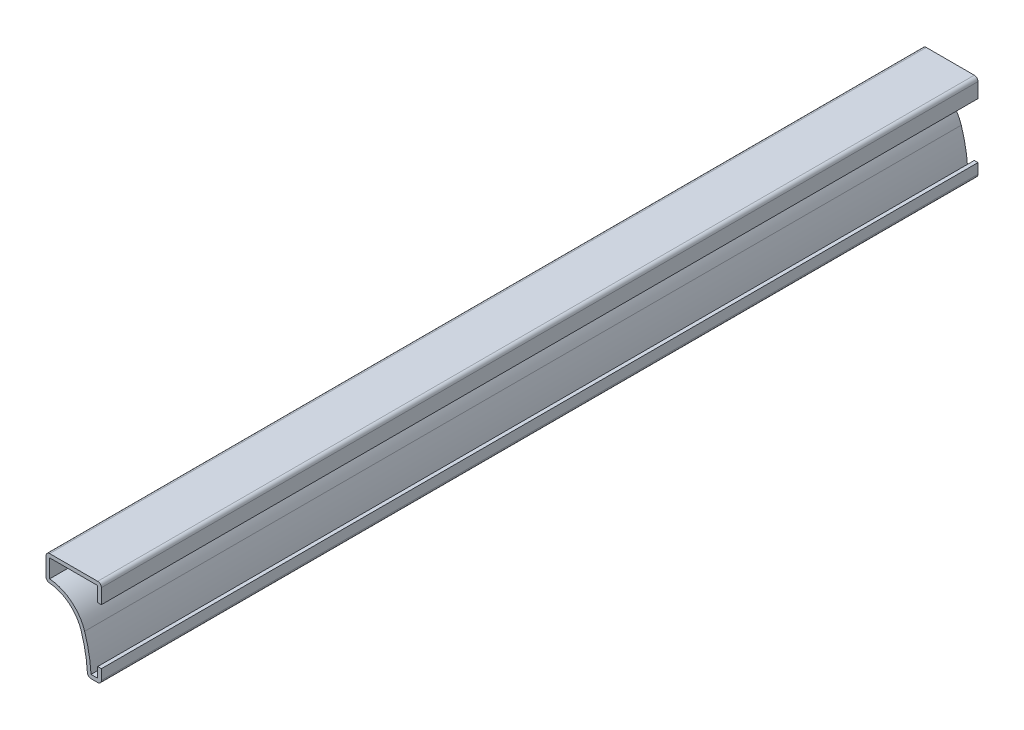
ISO-10303-21;
HEADER;
FILE_DESCRIPTION(('STEP AP214'),'2;1');
FILE_NAME('part.step','',(''),(''),'','','');
FILE_SCHEMA(('AUTOMOTIVE_DESIGN { 1 0 10303 214 1 1 1 1 }'));
ENDSEC;
DATA;
#1=APPLICATION_CONTEXT('core data for automotive mechanical design processes');
#2=APPLICATION_PROTOCOL_DEFINITION('international standard','automotive_design',2000,#1);
#3=PRODUCT_CONTEXT('',#1,'mechanical');
#4=PRODUCT('Part','Part','',(#3));
#5=PRODUCT_RELATED_PRODUCT_CATEGORY('part','',(#4));
#6=PRODUCT_DEFINITION_FORMATION('','',#4);
#7=PRODUCT_DEFINITION_CONTEXT('part definition',#1,'design');
#8=PRODUCT_DEFINITION('design','',#6,#7);
#9=PRODUCT_DEFINITION_SHAPE('','',#8);
#10=(LENGTH_UNIT() NAMED_UNIT(*) SI_UNIT(.MILLI.,.METRE.));
#11=(NAMED_UNIT(*) PLANE_ANGLE_UNIT() SI_UNIT($,.RADIAN.));
#12=(NAMED_UNIT(*) SI_UNIT($,.STERADIAN.) SOLID_ANGLE_UNIT());
#13=UNCERTAINTY_MEASURE_WITH_UNIT(LENGTH_MEASURE(1.E-05),#10,'distance_accuracy_value','');
#14=(GEOMETRIC_REPRESENTATION_CONTEXT(3) GLOBAL_UNCERTAINTY_ASSIGNED_CONTEXT((#13)) GLOBAL_UNIT_ASSIGNED_CONTEXT((#10,
#11,#12)) REPRESENTATION_CONTEXT('',''));
#15=CARTESIAN_POINT('',(0.,0.,0.));
#16=DIRECTION('',(0.,0.,1.));
#17=DIRECTION('',(1.,0.,0.));
#18=AXIS2_PLACEMENT_3D('',#15,#16,#17);
#19=CARTESIAN_POINT('',(0.,-23.8125,-301.625));
#20=DIRECTION('',(1.,0.,0.));
#21=DIRECTION('',(0.,0.,-1.));
#22=AXIS2_PLACEMENT_3D('',#19,#20,#21);
#23=PLANE('',#22);
#24=DIRECTION('',(0.,1.,0.));
#25=VECTOR('',#24,1.);
#26=CARTESIAN_POINT('',(0.,-23.8125,0.));
#27=LINE('',#26,#25);
#28=CARTESIAN_POINT('',(0.,-22.5425,0.));
#29=VERTEX_POINT('',#28);
#30=CARTESIAN_POINT('',(0.,-19.05,0.));
#31=VERTEX_POINT('',#30);
#32=EDGE_CURVE('E314',#29,#31,#27,.T.);
#33=ORIENTED_EDGE('',*,*,#32,.F.);
#34=DIRECTION('',(0.,0.,1.));
#35=VECTOR('',#34,1.);
#36=CARTESIAN_POINT('',(0.,-22.5425,-301.625));
#37=LINE('',#36,#35);
#38=CARTESIAN_POINT('',(0.,-22.5425,-301.625));
#39=VERTEX_POINT('',#38);
#40=EDGE_CURVE('E187',#29,#39,#37,.F.);
#41=ORIENTED_EDGE('',*,*,#40,.T.);
#42=DIRECTION('',(0.,1.,0.));
#43=VECTOR('',#42,1.);
#44=CARTESIAN_POINT('',(0.,-23.8125,-301.625));
#45=LINE('',#44,#43);
#46=CARTESIAN_POINT('',(0.,-19.05,-301.625));
#47=VERTEX_POINT('',#46);
#48=EDGE_CURVE('E180',#39,#47,#45,.T.);
#49=ORIENTED_EDGE('',*,*,#48,.T.);
#50=DIRECTION('',(0.,0.,1.));
#51=VECTOR('',#50,1.);
#52=CARTESIAN_POINT('',(0.,-19.05,-301.625));
#53=LINE('',#52,#51);
#54=EDGE_CURVE('E184',#47,#31,#53,.T.);
#55=ORIENTED_EDGE('',*,*,#54,.T.);
#56=EDGE_LOOP('',(#33,#41,#49,#55));
#57=FACE_BOUND('',#56,.T.);
#58=ADVANCED_FACE('F35',(#57),#23,.T.);
#59=CARTESIAN_POINT('',(-4.7625,-23.8125,-301.625));
#60=DIRECTION('',(0.,-1.,0.));
#61=DIRECTION('',(0.,0.,-1.));
#62=AXIS2_PLACEMENT_3D('',#59,#60,#61);
#63=PLANE('',#62);
#64=DIRECTION('',(1.,0.,0.));
#65=VECTOR('',#64,1.);
#66=CARTESIAN_POINT('',(-4.7625,-23.8125,-301.625));
#67=LINE('',#66,#65);
#68=CARTESIAN_POINT('',(-3.54950501525823,-23.8125,-301.625));
#69=VERTEX_POINT('',#68);
#70=CARTESIAN_POINT('',(-1.27,-23.8125,-301.625));
#71=VERTEX_POINT('',#70);
#72=EDGE_CURVE('E204',#69,#71,#67,.T.);
#73=ORIENTED_EDGE('',*,*,#72,.T.);
#74=DIRECTION('',(0.,0.,1.));
#75=VECTOR('',#74,1.);
#76=CARTESIAN_POINT('',(-1.27,-23.8125,-301.625));
#77=LINE('',#76,#75);
#78=CARTESIAN_POINT('',(-1.27,-23.8125,0.));
#79=VERTEX_POINT('',#78);
#80=EDGE_CURVE('E215',#71,#79,#77,.T.);
#81=ORIENTED_EDGE('',*,*,#80,.T.);
#82=DIRECTION('',(1.,0.,0.));
#83=VECTOR('',#82,1.);
#84=CARTESIAN_POINT('',(-4.7625,-23.8125,0.));
#85=LINE('',#84,#83);
#86=CARTESIAN_POINT('',(-3.54950501525823,-23.8125,0.));
#87=VERTEX_POINT('',#86);
#88=EDGE_CURVE('E190',#87,#79,#85,.T.);
#89=ORIENTED_EDGE('',*,*,#88,.F.);
#90=DIRECTION('',(0.,0.,1.));
#91=VECTOR('',#90,1.);
#92=CARTESIAN_POINT('',(-3.54950501525823,-23.8125,-301.625));
#93=LINE('',#92,#91);
#94=EDGE_CURVE('E213',#87,#69,#93,.F.);
#95=ORIENTED_EDGE('',*,*,#94,.T.);
#96=EDGE_LOOP('',(#73,#81,#89,#95));
#97=FACE_BOUND('',#96,.T.);
#98=ADVANCED_FACE('F377',(#97),#63,.T.);
#99=CARTESIAN_POINT('',(-50.7752021818597,-25.3233422066795,-301.625));
#100=DIRECTION('',(0.,0.,1.));
#101=DIRECTION('',(1.,0.,0.));
#102=AXIS2_PLACEMENT_3D('',#99,#100,#101);
#103=CYLINDRICAL_SURFACE('',#102,46.0375);
#104=CARTESIAN_POINT('',(-50.7752021818597,-25.3233422066795,-301.625));
#105=DIRECTION('',(0.,0.,-1.));
#106=DIRECTION('',(-1.,0.,0.));
#107=AXIS2_PLACEMENT_3D('',#104,#105,#106);
#108=CIRCLE('',#107,46.0375);
#109=CARTESIAN_POINT('',(-6.96420869262488,-11.1795005879316,-301.625));
#110=VERTEX_POINT('',#109);
#111=CARTESIAN_POINT('',(-4.81730896603947,-22.6171534820585,-301.625));
#112=VERTEX_POINT('',#111);
#113=EDGE_CURVE('E209',#110,#112,#108,.T.);
#114=ORIENTED_EDGE('',*,*,#113,.T.);
#115=DIRECTION('',(0.,0.,1.));
#116=VECTOR('',#115,1.);
#117=CARTESIAN_POINT('',(-4.81730896603948,-22.6171534820585,-301.625));
#118=LINE('',#117,#116);
#119=CARTESIAN_POINT('',(-4.81730896603947,-22.6171534820585,0.));
#120=VERTEX_POINT('',#119);
#121=EDGE_CURVE('E238',#112,#120,#118,.T.);
#122=ORIENTED_EDGE('',*,*,#121,.T.);
#123=CARTESIAN_POINT('',(-50.7752021818597,-25.3233422066795,0.));
#124=DIRECTION('',(0.,0.,-1.));
#125=DIRECTION('',(-1.,0.,0.));
#126=AXIS2_PLACEMENT_3D('',#123,#124,#125);
#127=CIRCLE('',#126,46.0375);
#128=CARTESIAN_POINT('',(-6.96420869262488,-11.1795005879316,0.));
#129=VERTEX_POINT('',#128);
#130=EDGE_CURVE('E275',#129,#120,#127,.T.);
#131=ORIENTED_EDGE('',*,*,#130,.F.);
#132=DIRECTION('',(0.,0.,1.));
#133=VECTOR('',#132,1.);
#134=CARTESIAN_POINT('',(-6.96420869262488,-11.1795005879316,-301.625));
#135=LINE('',#134,#133);
#136=EDGE_CURVE('E216',#110,#129,#135,.T.);
#137=ORIENTED_EDGE('',*,*,#136,.F.);
#138=EDGE_LOOP('',(#114,#122,#131,#137));
#139=FACE_BOUND('',#138,.T.);
#140=ADVANCED_FACE('F387',(#139),#103,.F.);
#141=CARTESIAN_POINT('',(-19.05,-15.08125,-301.625));
#142=DIRECTION('',(0.,0.,1.));
#143=DIRECTION('',(1.,0.,0.));
#144=AXIS2_PLACEMENT_3D('',#141,#142,#143);
#145=CYLINDRICAL_SURFACE('',#144,12.7);
#146=CARTESIAN_POINT('',(-19.05,-15.08125,0.));
#147=DIRECTION('',(0.,0.,-1.));
#148=DIRECTION('',(-1.,0.,0.));
#149=AXIS2_PLACEMENT_3D('',#146,#147,#148);
#150=CIRCLE('',#149,12.7);
#151=CARTESIAN_POINT('',(-17.8954545454545,-2.43383821760798,0.));
#152=VERTEX_POINT('',#151);
#153=EDGE_CURVE('E268',#152,#129,#150,.T.);
#154=ORIENTED_EDGE('',*,*,#153,.F.);
#155=DIRECTION('',(0.,0.,1.));
#156=VECTOR('',#155,1.);
#157=CARTESIAN_POINT('',(-17.8954545454545,-2.43383821760798,-301.625));
#158=LINE('',#157,#156);
#159=CARTESIAN_POINT('',(-17.8954545454545,-2.43383821760798,-301.625));
#160=VERTEX_POINT('',#159);
#161=EDGE_CURVE('E246',#152,#160,#158,.F.);
#162=ORIENTED_EDGE('',*,*,#161,.T.);
#163=CARTESIAN_POINT('',(-19.05,-15.08125,-301.625));
#164=DIRECTION('',(0.,0.,-1.));
#165=DIRECTION('',(-1.,0.,0.));
#166=AXIS2_PLACEMENT_3D('',#163,#164,#165);
#167=CIRCLE('',#166,12.7);
#168=EDGE_CURVE('E368',#160,#110,#167,.T.);
#169=ORIENTED_EDGE('',*,*,#168,.T.);
#170=ORIENTED_EDGE('',*,*,#136,.T.);
#171=EDGE_LOOP('',(#154,#162,#169,#170));
#172=FACE_BOUND('',#171,.T.);
#173=ADVANCED_FACE('F391',(#172),#145,.F.);
#174=CARTESIAN_POINT('',(-19.05,6.35,-301.625));
#175=DIRECTION('',(-1.,0.,0.));
#176=DIRECTION('',(0.,-1.,0.));
#177=AXIS2_PLACEMENT_3D('',#174,#175,#176);
#178=PLANE('',#177);
#179=DIRECTION('',(0.,-1.,0.));
#180=VECTOR('',#179,1.);
#181=CARTESIAN_POINT('',(-19.05,6.35,-301.625));
#182=LINE('',#181,#180);
#183=CARTESIAN_POINT('',(-19.05,5.08,-301.625));
#184=VERTEX_POINT('',#183);
#185=CARTESIAN_POINT('',(-19.05,-1.16909703936878,-301.625));
#186=VERTEX_POINT('',#185);
#187=EDGE_CURVE('E365',#184,#186,#182,.T.);
#188=ORIENTED_EDGE('',*,*,#187,.T.);
#189=DIRECTION('',(0.,0.,1.));
#190=VECTOR('',#189,1.);
#191=CARTESIAN_POINT('',(-19.05,-1.16909703936878,-301.625));
#192=LINE('',#191,#190);
#193=CARTESIAN_POINT('',(-19.05,-1.16909703936878,0.));
#194=VERTEX_POINT('',#193);
#195=EDGE_CURVE('E243',#186,#194,#192,.T.);
#196=ORIENTED_EDGE('',*,*,#195,.T.);
#197=DIRECTION('',(0.,-1.,0.));
#198=VECTOR('',#197,1.);
#199=CARTESIAN_POINT('',(-19.05,6.35,0.));
#200=LINE('',#199,#198);
#201=CARTESIAN_POINT('',(-19.05,5.08,0.));
#202=VERTEX_POINT('',#201);
#203=EDGE_CURVE('E265',#202,#194,#200,.T.);
#204=ORIENTED_EDGE('',*,*,#203,.F.);
#205=DIRECTION('',(0.,0.,1.));
#206=VECTOR('',#205,1.);
#207=CARTESIAN_POINT('',(-19.05,5.08,-301.625));
#208=LINE('',#207,#206);
#209=EDGE_CURVE('E241',#202,#184,#208,.F.);
#210=ORIENTED_EDGE('',*,*,#209,.T.);
#211=EDGE_LOOP('',(#188,#196,#204,#210));
#212=FACE_BOUND('',#211,.T.);
#213=ADVANCED_FACE('F398',(#212),#178,.T.);
#214=CARTESIAN_POINT('',(0.,6.35,-301.625));
#215=DIRECTION('',(0.,1.,0.));
#216=DIRECTION('',(-1.,0.,0.));
#217=AXIS2_PLACEMENT_3D('',#214,#215,#216);
#218=PLANE('',#217);
#219=DIRECTION('',(-1.,0.,0.));
#220=VECTOR('',#219,1.);
#221=CARTESIAN_POINT('',(0.,6.35,-301.625));
#222=LINE('',#221,#220);
#223=CARTESIAN_POINT('',(-1.27,6.35,-301.625));
#224=VERTEX_POINT('',#223);
#225=CARTESIAN_POINT('',(-17.78,6.35,-301.625));
#226=VERTEX_POINT('',#225);
#227=EDGE_CURVE('E257',#224,#226,#222,.T.);
#228=ORIENTED_EDGE('',*,*,#227,.T.);
#229=DIRECTION('',(0.,0.,1.));
#230=VECTOR('',#229,1.);
#231=CARTESIAN_POINT('',(-17.78,6.35,-301.625));
#232=LINE('',#231,#230);
#233=CARTESIAN_POINT('',(-17.78,6.35,0.));
#234=VERTEX_POINT('',#233);
#235=EDGE_CURVE('E43',#226,#234,#232,.T.);
#236=ORIENTED_EDGE('',*,*,#235,.T.);
#237=DIRECTION('',(-1.,0.,0.));
#238=VECTOR('',#237,1.);
#239=CARTESIAN_POINT('',(0.,6.35,0.));
#240=LINE('',#239,#238);
#241=CARTESIAN_POINT('',(-1.27,6.35,0.));
#242=VERTEX_POINT('',#241);
#243=EDGE_CURVE('E255',#242,#234,#240,.T.);
#244=ORIENTED_EDGE('',*,*,#243,.F.);
#245=DIRECTION('',(0.,0.,1.));
#246=VECTOR('',#245,1.);
#247=CARTESIAN_POINT('',(-1.27,6.35,-301.625));
#248=LINE('',#247,#246);
#249=EDGE_CURVE('E248',#242,#224,#248,.F.);
#250=ORIENTED_EDGE('',*,*,#249,.T.);
#251=EDGE_LOOP('',(#228,#236,#244,#250));
#252=FACE_BOUND('',#251,.T.);
#253=ADVANCED_FACE('F254',(#252),#218,.T.);
#254=CARTESIAN_POINT('',(0.,0.,-301.625));
#255=DIRECTION('',(1.,0.,0.));
#256=DIRECTION('',(0.,0.,-1.));
#257=AXIS2_PLACEMENT_3D('',#254,#255,#256);
#258=PLANE('',#257);
#259=DIRECTION('',(0.,1.,0.));
#260=VECTOR('',#259,1.);
#261=CARTESIAN_POINT('',(0.,0.,-301.625));
#262=LINE('',#261,#260);
#263=CARTESIAN_POINT('',(0.,0.,-301.625));
#264=VERTEX_POINT('',#263);
#265=CARTESIAN_POINT('',(0.,5.08,-301.625));
#266=VERTEX_POINT('',#265);
#267=EDGE_CURVE('E362',#264,#266,#262,.T.);
#268=ORIENTED_EDGE('',*,*,#267,.T.);
#269=DIRECTION('',(0.,0.,1.));
#270=VECTOR('',#269,1.);
#271=CARTESIAN_POINT('',(0.,5.08,-301.625));
#272=LINE('',#271,#270);
#273=CARTESIAN_POINT('',(0.,5.08,0.));
#274=VERTEX_POINT('',#273);
#275=EDGE_CURVE('E11',#266,#274,#272,.T.);
#276=ORIENTED_EDGE('',*,*,#275,.T.);
#277=DIRECTION('',(0.,1.,0.));
#278=VECTOR('',#277,1.);
#279=CARTESIAN_POINT('',(0.,0.,0.));
#280=LINE('',#279,#278);
#281=CARTESIAN_POINT('',(0.,0.,0.));
#282=VERTEX_POINT('',#281);
#283=EDGE_CURVE('E266',#282,#274,#280,.T.);
#284=ORIENTED_EDGE('',*,*,#283,.F.);
#285=DIRECTION('',(0.,0.,1.));
#286=VECTOR('',#285,1.);
#287=CARTESIAN_POINT('',(0.,0.,-301.625));
#288=LINE('',#287,#286);
#289=EDGE_CURVE('E281',#264,#282,#288,.T.);
#290=ORIENTED_EDGE('',*,*,#289,.F.);
#291=EDGE_LOOP('',(#268,#276,#284,#290));
#292=FACE_BOUND('',#291,.T.);
#293=ADVANCED_FACE('F529',(#292),#258,.T.);
#294=CARTESIAN_POINT('',(0.,0.,-301.625));
#295=DIRECTION('',(0.,1.,0.));
#296=DIRECTION('',(0.,0.,1.));
#297=AXIS2_PLACEMENT_3D('',#294,#295,#296);
#298=PLANE('',#297);
#299=DIRECTION('',(-1.,0.,0.));
#300=VECTOR('',#299,1.);
#301=CARTESIAN_POINT('',(0.,0.,0.));
#302=LINE('',#301,#300);
#303=CARTESIAN_POINT('',(-1.27,0.,0.));
#304=VERTEX_POINT('',#303);
#305=EDGE_CURVE('E270',#282,#304,#302,.T.);
#306=ORIENTED_EDGE('',*,*,#305,.T.);
#307=DIRECTION('',(0.,0.,1.));
#308=VECTOR('',#307,1.);
#309=CARTESIAN_POINT('',(-1.27,0.,-301.625));
#310=LINE('',#309,#308);
#311=CARTESIAN_POINT('',(-1.27,0.,-301.625));
#312=VERTEX_POINT('',#311);
#313=EDGE_CURVE('E283',#312,#304,#310,.T.);
#314=ORIENTED_EDGE('',*,*,#313,.F.);
#315=DIRECTION('',(-1.,0.,0.));
#316=VECTOR('',#315,1.);
#317=CARTESIAN_POINT('',(0.,0.,-301.625));
#318=LINE('',#317,#316);
#319=EDGE_CURVE('E360',#264,#312,#318,.T.);
#320=ORIENTED_EDGE('',*,*,#319,.F.);
#321=ORIENTED_EDGE('',*,*,#289,.T.);
#322=EDGE_LOOP('',(#306,#314,#320,#321));
#323=FACE_BOUND('',#322,.T.);
#324=ADVANCED_FACE('F329',(#323),#298,.F.);
#325=CARTESIAN_POINT('',(-1.27,0.,-301.625));
#326=DIRECTION('',(1.,0.,0.));
#327=DIRECTION('',(0.,0.,-1.));
#328=AXIS2_PLACEMENT_3D('',#325,#326,#327);
#329=PLANE('',#328);
#330=DIRECTION('',(0.,1.,0.));
#331=VECTOR('',#330,1.);
#332=CARTESIAN_POINT('',(-1.27,0.,0.));
#333=LINE('',#332,#331);
#334=CARTESIAN_POINT('',(-1.27,5.08,0.));
#335=VERTEX_POINT('',#334);
#336=EDGE_CURVE('E325',#304,#335,#333,.T.);
#337=ORIENTED_EDGE('',*,*,#336,.T.);
#338=DIRECTION('',(0.,0.,1.));
#339=VECTOR('',#338,1.);
#340=CARTESIAN_POINT('',(-1.27,5.08,-301.625));
#341=LINE('',#340,#339);
#342=CARTESIAN_POINT('',(-1.27,5.08,-301.625));
#343=VERTEX_POINT('',#342);
#344=EDGE_CURVE('E286',#343,#335,#341,.T.);
#345=ORIENTED_EDGE('',*,*,#344,.F.);
#346=DIRECTION('',(0.,1.,0.));
#347=VECTOR('',#346,1.);
#348=CARTESIAN_POINT('',(-1.27,0.,-301.625));
#349=LINE('',#348,#347);
#350=EDGE_CURVE('E337',#312,#343,#349,.T.);
#351=ORIENTED_EDGE('',*,*,#350,.F.);
#352=ORIENTED_EDGE('',*,*,#313,.T.);
#353=EDGE_LOOP('',(#337,#345,#351,#352));
#354=FACE_BOUND('',#353,.T.);
#355=ADVANCED_FACE('F335',(#354),#329,.F.);
#356=CARTESIAN_POINT('',(0.,5.08,-301.625));
#357=DIRECTION('',(0.,1.,0.));
#358=DIRECTION('',(-1.,0.,0.));
#359=AXIS2_PLACEMENT_3D('',#356,#357,#358);
#360=PLANE('',#359);
#361=DIRECTION('',(-1.,0.,0.));
#362=VECTOR('',#361,1.);
#363=CARTESIAN_POINT('',(0.,5.08,0.));
#364=LINE('',#363,#362);
#365=CARTESIAN_POINT('',(-17.78,5.08,0.));
#366=VERTEX_POINT('',#365);
#367=EDGE_CURVE('E323',#335,#366,#364,.T.);
#368=ORIENTED_EDGE('',*,*,#367,.T.);
#369=DIRECTION('',(0.,0.,1.));
#370=VECTOR('',#369,1.);
#371=CARTESIAN_POINT('',(-17.78,5.08,-301.625));
#372=LINE('',#371,#370);
#373=CARTESIAN_POINT('',(-17.78,5.08,-301.625));
#374=VERTEX_POINT('',#373);
#375=EDGE_CURVE('E289',#374,#366,#372,.T.);
#376=ORIENTED_EDGE('',*,*,#375,.F.);
#377=DIRECTION('',(-1.,0.,0.));
#378=VECTOR('',#377,1.);
#379=CARTESIAN_POINT('',(0.,5.08,-301.625));
#380=LINE('',#379,#378);
#381=EDGE_CURVE('E351',#343,#374,#380,.T.);
#382=ORIENTED_EDGE('',*,*,#381,.F.);
#383=ORIENTED_EDGE('',*,*,#344,.T.);
#384=EDGE_LOOP('',(#368,#376,#382,#383));
#385=FACE_BOUND('',#384,.T.);
#386=ADVANCED_FACE('F343',(#385),#360,.F.);
#387=CARTESIAN_POINT('',(-17.78,6.35,-301.625));
#388=DIRECTION('',(-1.,0.,0.));
#389=DIRECTION('',(0.,-1.,0.));
#390=AXIS2_PLACEMENT_3D('',#387,#388,#389);
#391=PLANE('',#390);
#392=DIRECTION('',(0.,-1.,0.));
#393=VECTOR('',#392,1.);
#394=CARTESIAN_POINT('',(-17.78,6.35,0.));
#395=LINE('',#394,#393);
#396=CARTESIAN_POINT('',(-17.78,-1.16909703936878,0.));
#397=VERTEX_POINT('',#396);
#398=EDGE_CURVE('E321',#366,#397,#395,.T.);
#399=ORIENTED_EDGE('',*,*,#398,.T.);
#400=DIRECTION('',(0.,0.,1.));
#401=VECTOR('',#400,1.);
#402=CARTESIAN_POINT('',(-17.78,-1.16909703936878,-301.625));
#403=LINE('',#402,#401);
#404=CARTESIAN_POINT('',(-17.78,-1.16909703936878,-301.625));
#405=VERTEX_POINT('',#404);
#406=EDGE_CURVE('E292',#405,#397,#403,.T.);
#407=ORIENTED_EDGE('',*,*,#406,.F.);
#408=DIRECTION('',(0.,-1.,0.));
#409=VECTOR('',#408,1.);
#410=CARTESIAN_POINT('',(-17.78,6.35,-301.625));
#411=LINE('',#410,#409);
#412=EDGE_CURVE('E349',#374,#405,#411,.T.);
#413=ORIENTED_EDGE('',*,*,#412,.F.);
#414=ORIENTED_EDGE('',*,*,#375,.T.);
#415=EDGE_LOOP('',(#399,#407,#413,#414));
#416=FACE_BOUND('',#415,.T.);
#417=ADVANCED_FACE('F347',(#416),#391,.F.);
#418=CARTESIAN_POINT('',(-19.05,-15.08125,-301.625));
#419=DIRECTION('',(0.,0.,1.));
#420=DIRECTION('',(1.,0.,0.));
#421=AXIS2_PLACEMENT_3D('',#418,#419,#420);
#422=CYLINDRICAL_SURFACE('',#421,13.97);
#423=CARTESIAN_POINT('',(-19.05,-15.08125,0.));
#424=DIRECTION('',(0.,0.,1.));
#425=DIRECTION('',(1.,0.,0.));
#426=AXIS2_PLACEMENT_3D('',#423,#424,#425);
#427=CIRCLE('',#426,13.97);
#428=CARTESIAN_POINT('',(-5.75562956188737,-10.7893256467248,0.));
#429=VERTEX_POINT('',#428);
#430=EDGE_CURVE('E319',#397,#429,#427,.F.);
#431=ORIENTED_EDGE('',*,*,#430,.T.);
#432=DIRECTION('',(0.,0.,1.));
#433=VECTOR('',#432,1.);
#434=CARTESIAN_POINT('',(-5.75562956188737,-10.7893256467248,-301.625));
#435=LINE('',#434,#433);
#436=CARTESIAN_POINT('',(-5.75562956188737,-10.7893256467248,-301.625));
#437=VERTEX_POINT('',#436);
#438=EDGE_CURVE('E295',#437,#429,#435,.T.);
#439=ORIENTED_EDGE('',*,*,#438,.F.);
#440=CARTESIAN_POINT('',(-19.05,-15.08125,-301.625));
#441=DIRECTION('',(0.,0.,1.));
#442=DIRECTION('',(1.,0.,0.));
#443=AXIS2_PLACEMENT_3D('',#440,#441,#442);
#444=CIRCLE('',#443,13.97);
#445=EDGE_CURVE('E352',#405,#437,#444,.F.);
#446=ORIENTED_EDGE('',*,*,#445,.F.);
#447=ORIENTED_EDGE('',*,*,#406,.T.);
#448=EDGE_LOOP('',(#431,#439,#446,#447));
#449=FACE_BOUND('',#448,.T.);
#450=ADVANCED_FACE('F491',(#449),#422,.T.);
#451=CARTESIAN_POINT('',(-50.7752021818597,-25.3233422066795,-301.625));
#452=DIRECTION('',(0.,0.,1.));
#453=DIRECTION('',(1.,0.,0.));
#454=AXIS2_PLACEMENT_3D('',#451,#452,#453);
#455=CYLINDRICAL_SURFACE('',#454,47.3075);
#456=CARTESIAN_POINT('',(-50.7752021818597,-25.3233422066795,0.));
#457=DIRECTION('',(0.,0.,1.));
#458=DIRECTION('',(1.,0.,0.));
#459=AXIS2_PLACEMENT_3D('',#456,#457,#458);
#460=CIRCLE('',#459,47.3075);
#461=CARTESIAN_POINT('',(-3.54950501525823,-22.5425,0.));
#462=VERTEX_POINT('',#461);
#463=EDGE_CURVE('E312',#429,#462,#460,.F.);
#464=ORIENTED_EDGE('',*,*,#463,.T.);
#465=DIRECTION('',(0.,0.,1.));
#466=VECTOR('',#465,1.);
#467=CARTESIAN_POINT('',(-3.54950501525823,-22.5425,-301.625));
#468=LINE('',#467,#466);
#469=CARTESIAN_POINT('',(-3.54950501525823,-22.5425,-301.625));
#470=VERTEX_POINT('',#469);
#471=EDGE_CURVE('E298',#470,#462,#468,.T.);
#472=ORIENTED_EDGE('',*,*,#471,.F.);
#473=CARTESIAN_POINT('',(-50.7752021818597,-25.3233422066795,-301.625));
#474=DIRECTION('',(0.,0.,1.));
#475=DIRECTION('',(1.,0.,0.));
#476=AXIS2_PLACEMENT_3D('',#473,#474,#475);
#477=CIRCLE('',#476,47.3075);
#478=EDGE_CURVE('E355',#437,#470,#477,.F.);
#479=ORIENTED_EDGE('',*,*,#478,.F.);
#480=ORIENTED_EDGE('',*,*,#438,.T.);
#481=EDGE_LOOP('',(#464,#472,#479,#480));
#482=FACE_BOUND('',#481,.T.);
#483=ADVANCED_FACE('F483',(#482),#455,.T.);
#484=CARTESIAN_POINT('',(-4.7625,-22.5425,-301.625));
#485=DIRECTION('',(0.,-1.,0.));
#486=DIRECTION('',(0.,0.,-1.));
#487=AXIS2_PLACEMENT_3D('',#484,#485,#486);
#488=PLANE('',#487);
#489=DIRECTION('',(1.,0.,0.));
#490=VECTOR('',#489,1.);
#491=CARTESIAN_POINT('',(-4.7625,-22.5425,0.));
#492=LINE('',#491,#490);
#493=CARTESIAN_POINT('',(-1.27,-22.5425,0.));
#494=VERTEX_POINT('',#493);
#495=EDGE_CURVE('E310',#462,#494,#492,.T.);
#496=ORIENTED_EDGE('',*,*,#495,.T.);
#497=DIRECTION('',(0.,0.,1.));
#498=VECTOR('',#497,1.);
#499=CARTESIAN_POINT('',(-1.27,-22.5425,-301.625));
#500=LINE('',#499,#498);
#501=CARTESIAN_POINT('',(-1.27,-22.5425,-301.625));
#502=VERTEX_POINT('',#501);
#503=EDGE_CURVE('E206',#502,#494,#500,.T.);
#504=ORIENTED_EDGE('',*,*,#503,.F.);
#505=DIRECTION('',(1.,0.,0.));
#506=VECTOR('',#505,1.);
#507=CARTESIAN_POINT('',(-4.7625,-22.5425,-301.625));
#508=LINE('',#507,#506);
#509=EDGE_CURVE('E597',#470,#502,#508,.T.);
#510=ORIENTED_EDGE('',*,*,#509,.F.);
#511=ORIENTED_EDGE('',*,*,#471,.T.);
#512=EDGE_LOOP('',(#496,#504,#510,#511));
#513=FACE_BOUND('',#512,.T.);
#514=ADVANCED_FACE('F476',(#513),#488,.F.);
#515=CARTESIAN_POINT('',(-1.27,-23.8125,-301.625));
#516=DIRECTION('',(1.,0.,0.));
#517=DIRECTION('',(0.,0.,-1.));
#518=AXIS2_PLACEMENT_3D('',#515,#516,#517);
#519=PLANE('',#518);
#520=DIRECTION('',(0.,1.,0.));
#521=VECTOR('',#520,1.);
#522=CARTESIAN_POINT('',(-1.27,-23.8125,0.));
#523=LINE('',#522,#521);
#524=CARTESIAN_POINT('',(-1.27,-19.05,0.));
#525=VERTEX_POINT('',#524);
#526=EDGE_CURVE('E305',#494,#525,#523,.T.);
#527=ORIENTED_EDGE('',*,*,#526,.T.);
#528=DIRECTION('',(0.,0.,1.));
#529=VECTOR('',#528,1.);
#530=CARTESIAN_POINT('',(-1.27,-19.05,-301.625));
#531=LINE('',#530,#529);
#532=CARTESIAN_POINT('',(-1.27,-19.05,-301.625));
#533=VERTEX_POINT('',#532);
#534=EDGE_CURVE('E203',#533,#525,#531,.T.);
#535=ORIENTED_EDGE('',*,*,#534,.F.);
#536=DIRECTION('',(0.,1.,0.));
#537=VECTOR('',#536,1.);
#538=CARTESIAN_POINT('',(-1.27,-23.8125,-301.625));
#539=LINE('',#538,#537);
#540=EDGE_CURVE('E195',#502,#533,#539,.T.);
#541=ORIENTED_EDGE('',*,*,#540,.F.);
#542=ORIENTED_EDGE('',*,*,#503,.T.);
#543=EDGE_LOOP('',(#527,#535,#541,#542));
#544=FACE_BOUND('',#543,.T.);
#545=ADVANCED_FACE('F304',(#544),#519,.F.);
#546=CARTESIAN_POINT('',(-1.27,-19.05,-301.625));
#547=DIRECTION('',(0.,-1.,0.));
#548=DIRECTION('',(0.,0.,-1.));
#549=AXIS2_PLACEMENT_3D('',#546,#547,#548);
#550=PLANE('',#549);
#551=DIRECTION('',(1.,0.,0.));
#552=VECTOR('',#551,1.);
#553=CARTESIAN_POINT('',(-1.27,-19.05,0.));
#554=LINE('',#553,#552);
#555=EDGE_CURVE('E202',#525,#31,#554,.T.);
#556=ORIENTED_EDGE('',*,*,#555,.T.);
#557=ORIENTED_EDGE('',*,*,#54,.F.);
#558=DIRECTION('',(1.,0.,0.));
#559=VECTOR('',#558,1.);
#560=CARTESIAN_POINT('',(-1.27,-19.05,-301.625));
#561=LINE('',#560,#559);
#562=EDGE_CURVE('E189',#533,#47,#561,.T.);
#563=ORIENTED_EDGE('',*,*,#562,.F.);
#564=ORIENTED_EDGE('',*,*,#534,.T.);
#565=EDGE_LOOP('',(#556,#557,#563,#564));
#566=FACE_BOUND('',#565,.T.);
#567=ADVANCED_FACE('F200',(#566),#550,.F.);
#568=CARTESIAN_POINT('',(-50.7752021818597,-25.3233422066795,-301.625));
#569=DIRECTION('',(0.,0.,1.));
#570=DIRECTION('',(1.,0.,0.));
#571=AXIS2_PLACEMENT_3D('',#568,#569,#570);
#572=PLANE('',#571);
#573=ORIENTED_EDGE('',*,*,#48,.F.);
#574=CARTESIAN_POINT('',(-1.27,-22.5425,-301.625));
#575=DIRECTION('',(0.,0.,1.));
#576=DIRECTION('',(1.,0.,0.));
#577=AXIS2_PLACEMENT_3D('',#574,#575,#576);
#578=CIRCLE('',#577,1.27);
#579=EDGE_CURVE('E236',#39,#71,#578,.F.);
#580=ORIENTED_EDGE('',*,*,#579,.T.);
#581=ORIENTED_EDGE('',*,*,#72,.F.);
#582=CARTESIAN_POINT('',(-3.54950501525823,-22.5425,-301.625));
#583=DIRECTION('',(0.,0.,1.));
#584=DIRECTION('',(1.,0.,0.));
#585=AXIS2_PLACEMENT_3D('',#582,#583,#584);
#586=CIRCLE('',#585,1.27);
#587=EDGE_CURVE('E234',#69,#112,#586,.F.);
#588=ORIENTED_EDGE('',*,*,#587,.T.);
#589=ORIENTED_EDGE('',*,*,#113,.F.);
#590=ORIENTED_EDGE('',*,*,#168,.F.);
#591=CARTESIAN_POINT('',(-17.78,-1.16909703936878,-301.625));
#592=DIRECTION('',(0.,0.,1.));
#593=DIRECTION('',(1.,0.,0.));
#594=AXIS2_PLACEMENT_3D('',#591,#592,#593);
#595=CIRCLE('',#594,1.27);
#596=EDGE_CURVE('E232',#160,#186,#595,.F.);
#597=ORIENTED_EDGE('',*,*,#596,.T.);
#598=ORIENTED_EDGE('',*,*,#187,.F.);
#599=CARTESIAN_POINT('',(-17.78,5.08,-301.625));
#600=DIRECTION('',(0.,0.,1.));
#601=DIRECTION('',(1.,0.,0.));
#602=AXIS2_PLACEMENT_3D('',#599,#600,#601);
#603=CIRCLE('',#602,1.27);
#604=EDGE_CURVE('E56',#184,#226,#603,.F.);
#605=ORIENTED_EDGE('',*,*,#604,.T.);
#606=ORIENTED_EDGE('',*,*,#227,.F.);
#607=CARTESIAN_POINT('',(-1.27,5.08,-301.625));
#608=DIRECTION('',(0.,0.,1.));
#609=DIRECTION('',(1.,0.,0.));
#610=AXIS2_PLACEMENT_3D('',#607,#608,#609);
#611=CIRCLE('',#610,1.27);
#612=EDGE_CURVE('E50',#224,#266,#611,.F.);
#613=ORIENTED_EDGE('',*,*,#612,.T.);
#614=ORIENTED_EDGE('',*,*,#267,.F.);
#615=ORIENTED_EDGE('',*,*,#319,.T.);
#616=ORIENTED_EDGE('',*,*,#350,.T.);
#617=ORIENTED_EDGE('',*,*,#381,.T.);
#618=ORIENTED_EDGE('',*,*,#412,.T.);
#619=ORIENTED_EDGE('',*,*,#445,.T.);
#620=ORIENTED_EDGE('',*,*,#478,.T.);
#621=ORIENTED_EDGE('',*,*,#509,.T.);
#622=ORIENTED_EDGE('',*,*,#540,.T.);
#623=ORIENTED_EDGE('',*,*,#562,.T.);
#624=EDGE_LOOP('',(#573,#580,#581,#588,#589,#590,#597,#598,#605,#606,#613,#614,#615,#616,#617,
#618,#619,#620,#621,#622,#623));
#625=FACE_BOUND('',#624,.T.);
#626=ADVANCED_FACE('F193',(#625),#572,.F.);
#627=CARTESIAN_POINT('',(-50.7752021818597,-25.3233422066795,0.));
#628=DIRECTION('',(0.,0.,1.));
#629=DIRECTION('',(1.,0.,0.));
#630=AXIS2_PLACEMENT_3D('',#627,#628,#629);
#631=PLANE('',#630);
#632=ORIENTED_EDGE('',*,*,#88,.T.);
#633=CARTESIAN_POINT('',(-1.27,-22.5425,0.));
#634=DIRECTION('',(0.,0.,1.));
#635=DIRECTION('',(1.,0.,0.));
#636=AXIS2_PLACEMENT_3D('',#633,#634,#635);
#637=CIRCLE('',#636,1.27);
#638=EDGE_CURVE('E227',#79,#29,#637,.T.);
#639=ORIENTED_EDGE('',*,*,#638,.T.);
#640=ORIENTED_EDGE('',*,*,#32,.T.);
#641=ORIENTED_EDGE('',*,*,#555,.F.);
#642=ORIENTED_EDGE('',*,*,#526,.F.);
#643=ORIENTED_EDGE('',*,*,#495,.F.);
#644=ORIENTED_EDGE('',*,*,#463,.F.);
#645=ORIENTED_EDGE('',*,*,#430,.F.);
#646=ORIENTED_EDGE('',*,*,#398,.F.);
#647=ORIENTED_EDGE('',*,*,#367,.F.);
#648=ORIENTED_EDGE('',*,*,#336,.F.);
#649=ORIENTED_EDGE('',*,*,#305,.F.);
#650=ORIENTED_EDGE('',*,*,#283,.T.);
#651=CARTESIAN_POINT('',(-1.27,5.08,0.));
#652=DIRECTION('',(0.,0.,1.));
#653=DIRECTION('',(1.,0.,0.));
#654=AXIS2_PLACEMENT_3D('',#651,#652,#653);
#655=CIRCLE('',#654,1.27);
#656=EDGE_CURVE('E219',#274,#242,#655,.T.);
#657=ORIENTED_EDGE('',*,*,#656,.T.);
#658=ORIENTED_EDGE('',*,*,#243,.T.);
#659=CARTESIAN_POINT('',(-17.78,5.08,0.));
#660=DIRECTION('',(0.,0.,1.));
#661=DIRECTION('',(1.,0.,0.));
#662=AXIS2_PLACEMENT_3D('',#659,#660,#661);
#663=CIRCLE('',#662,1.27);
#664=EDGE_CURVE('E221',#234,#202,#663,.T.);
#665=ORIENTED_EDGE('',*,*,#664,.T.);
#666=ORIENTED_EDGE('',*,*,#203,.T.);
#667=CARTESIAN_POINT('',(-17.78,-1.16909703936878,0.));
#668=DIRECTION('',(0.,0.,1.));
#669=DIRECTION('',(1.,0.,0.));
#670=AXIS2_PLACEMENT_3D('',#667,#668,#669);
#671=CIRCLE('',#670,1.27);
#672=EDGE_CURVE('E223',#194,#152,#671,.T.);
#673=ORIENTED_EDGE('',*,*,#672,.T.);
#674=ORIENTED_EDGE('',*,*,#153,.T.);
#675=ORIENTED_EDGE('',*,*,#130,.T.);
#676=CARTESIAN_POINT('',(-3.54950501525823,-22.5425,0.));
#677=DIRECTION('',(0.,0.,1.));
#678=DIRECTION('',(1.,0.,0.));
#679=AXIS2_PLACEMENT_3D('',#676,#677,#678);
#680=CIRCLE('',#679,1.27);
#681=EDGE_CURVE('E225',#120,#87,#680,.T.);
#682=ORIENTED_EDGE('',*,*,#681,.T.);
#683=EDGE_LOOP('',(#632,#639,#640,#641,#642,#643,#644,#645,#646,#647,#648,#649,#650,#657,#658,
#665,#666,#673,#674,#675,#682));
#684=FACE_BOUND('',#683,.T.);
#685=ADVANCED_FACE('F261',(#684),#631,.T.);
#686=CARTESIAN_POINT('',(-1.27,-22.5425,-301.625));
#687=DIRECTION('',(0.,0.,1.));
#688=DIRECTION('',(1.,0.,0.));
#689=AXIS2_PLACEMENT_3D('',#686,#687,#688);
#690=CYLINDRICAL_SURFACE('',#689,1.27);
#691=ORIENTED_EDGE('',*,*,#579,.F.);
#692=ORIENTED_EDGE('',*,*,#40,.F.);
#693=ORIENTED_EDGE('',*,*,#638,.F.);
#694=ORIENTED_EDGE('',*,*,#80,.F.);
#695=EDGE_LOOP('',(#691,#692,#693,#694));
#696=FACE_BOUND('',#695,.T.);
#697=ADVANCED_FACE('F372',(#696),#690,.T.);
#698=CARTESIAN_POINT('',(-3.54950501525823,-22.5425,-301.625));
#699=DIRECTION('',(0.,0.,1.));
#700=DIRECTION('',(1.,0.,0.));
#701=AXIS2_PLACEMENT_3D('',#698,#699,#700);
#702=CYLINDRICAL_SURFACE('',#701,1.27);
#703=ORIENTED_EDGE('',*,*,#587,.F.);
#704=ORIENTED_EDGE('',*,*,#94,.F.);
#705=ORIENTED_EDGE('',*,*,#681,.F.);
#706=ORIENTED_EDGE('',*,*,#121,.F.);
#707=EDGE_LOOP('',(#703,#704,#705,#706));
#708=FACE_BOUND('',#707,.T.);
#709=ADVANCED_FACE('F381',(#708),#702,.T.);
#710=CARTESIAN_POINT('',(-17.78,-1.16909703936878,-301.625));
#711=DIRECTION('',(0.,0.,1.));
#712=DIRECTION('',(1.,0.,0.));
#713=AXIS2_PLACEMENT_3D('',#710,#711,#712);
#714=CYLINDRICAL_SURFACE('',#713,1.27);
#715=ORIENTED_EDGE('',*,*,#596,.F.);
#716=ORIENTED_EDGE('',*,*,#161,.F.);
#717=ORIENTED_EDGE('',*,*,#672,.F.);
#718=ORIENTED_EDGE('',*,*,#195,.F.);
#719=EDGE_LOOP('',(#715,#716,#717,#718));
#720=FACE_BOUND('',#719,.T.);
#721=ADVANCED_FACE('F396',(#720),#714,.T.);
#722=CARTESIAN_POINT('',(-17.78,5.08,-301.625));
#723=DIRECTION('',(0.,0.,1.));
#724=DIRECTION('',(1.,0.,0.));
#725=AXIS2_PLACEMENT_3D('',#722,#723,#724);
#726=CYLINDRICAL_SURFACE('',#725,1.27);
#727=ORIENTED_EDGE('',*,*,#604,.F.);
#728=ORIENTED_EDGE('',*,*,#209,.F.);
#729=ORIENTED_EDGE('',*,*,#664,.F.);
#730=ORIENTED_EDGE('',*,*,#235,.F.);
#731=EDGE_LOOP('',(#727,#728,#729,#730));
#732=FACE_BOUND('',#731,.T.);
#733=ADVANCED_FACE('F400',(#732),#726,.T.);
#734=CARTESIAN_POINT('',(-1.27,5.08,-301.625));
#735=DIRECTION('',(0.,0.,1.));
#736=DIRECTION('',(1.,0.,0.));
#737=AXIS2_PLACEMENT_3D('',#734,#735,#736);
#738=CYLINDRICAL_SURFACE('',#737,1.27);
#739=ORIENTED_EDGE('',*,*,#612,.F.);
#740=ORIENTED_EDGE('',*,*,#249,.F.);
#741=ORIENTED_EDGE('',*,*,#656,.F.);
#742=ORIENTED_EDGE('',*,*,#275,.F.);
#743=EDGE_LOOP('',(#739,#740,#741,#742));
#744=FACE_BOUND('',#743,.T.);
#745=ADVANCED_FACE('F37',(#744),#738,.T.);
#746=CLOSED_SHELL('',(#58,#98,#140,#173,#213,#253,#293,#324,#355,#386,#417,#450,#483,#514,#545,
#567,#626,#685,#697,#709,#721,#733,#745));
#747=MANIFOLD_SOLID_BREP('B2',#746);
#748=ADVANCED_BREP_SHAPE_REPRESENTATION('',(#18,#747),#14);
#749=SHAPE_DEFINITION_REPRESENTATION(#9,#748);
ENDSEC;
END-ISO-10303-21;
